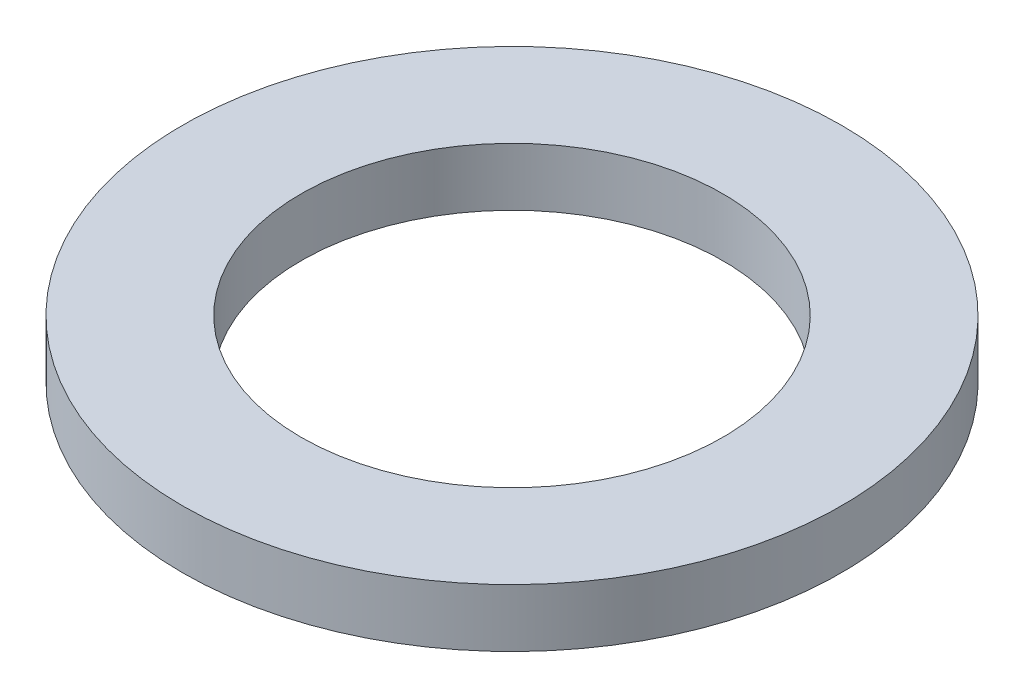
ISO-10303-21;
HEADER;
FILE_DESCRIPTION(('STEP AP214'),'2;1');
FILE_NAME('part.step','',(''),(''),'','','');
FILE_SCHEMA(('AUTOMOTIVE_DESIGN { 1 0 10303 214 1 1 1 1 }'));
ENDSEC;
DATA;
#1=APPLICATION_CONTEXT('core data for automotive mechanical design processes');
#2=APPLICATION_PROTOCOL_DEFINITION('international standard','automotive_design',2000,#1);
#3=PRODUCT_CONTEXT('',#1,'mechanical');
#4=PRODUCT('Part','Part','',(#3));
#5=PRODUCT_RELATED_PRODUCT_CATEGORY('part','',(#4));
#6=PRODUCT_DEFINITION_FORMATION('','',#4);
#7=PRODUCT_DEFINITION_CONTEXT('part definition',#1,'design');
#8=PRODUCT_DEFINITION('design','',#6,#7);
#9=PRODUCT_DEFINITION_SHAPE('','',#8);
#10=(LENGTH_UNIT() NAMED_UNIT(*) SI_UNIT(.MILLI.,.METRE.));
#11=(NAMED_UNIT(*) PLANE_ANGLE_UNIT() SI_UNIT($,.RADIAN.));
#12=(NAMED_UNIT(*) SI_UNIT($,.STERADIAN.) SOLID_ANGLE_UNIT());
#13=UNCERTAINTY_MEASURE_WITH_UNIT(LENGTH_MEASURE(1.E-05),#10,'distance_accuracy_value','');
#14=(GEOMETRIC_REPRESENTATION_CONTEXT(3) GLOBAL_UNCERTAINTY_ASSIGNED_CONTEXT((#13)) GLOBAL_UNIT_ASSIGNED_CONTEXT((#10,
#11,#12)) REPRESENTATION_CONTEXT('',''));
#15=CARTESIAN_POINT('',(0.,0.,0.));
#16=DIRECTION('',(0.,0.,1.));
#17=DIRECTION('',(1.,0.,0.));
#18=AXIS2_PLACEMENT_3D('',#15,#16,#17);
#19=CARTESIAN_POINT('',(0.,11.,0.));
#20=DIRECTION('',(0.,-1.,0.));
#21=DIRECTION('',(0.,0.,-1.));
#22=AXIS2_PLACEMENT_3D('',#19,#20,#21);
#23=CYLINDRICAL_SURFACE('',#22,62.5);
#24=CARTESIAN_POINT('',(0.,11.,0.));
#25=DIRECTION('',(0.,1.,0.));
#26=DIRECTION('',(0.,0.,1.));
#27=AXIS2_PLACEMENT_3D('',#24,#25,#26);
#28=CIRCLE('',#27,62.5);
#29=CARTESIAN_POINT('',(0.,11.,62.5));
#30=VERTEX_POINT('',#29);
#31=EDGE_CURVE('E10',#30,#30,#28,.T.);
#32=ORIENTED_EDGE('',*,*,#31,.F.);
#33=EDGE_LOOP('',(#32));
#34=FACE_BOUND('',#33,.T.);
#35=CARTESIAN_POINT('',(0.,0.,0.));
#36=DIRECTION('',(0.,1.,0.));
#37=DIRECTION('',(0.,0.,1.));
#38=AXIS2_PLACEMENT_3D('',#35,#36,#37);
#39=CIRCLE('',#38,62.5);
#40=CARTESIAN_POINT('',(0.,0.,62.5));
#41=VERTEX_POINT('',#40);
#42=EDGE_CURVE('E37',#41,#41,#39,.T.);
#43=ORIENTED_EDGE('',*,*,#42,.T.);
#44=EDGE_LOOP('',(#43));
#45=FACE_BOUND('',#44,.T.);
#46=ADVANCED_FACE('F40',(#34,#45),#23,.T.);
#47=CARTESIAN_POINT('',(0.,11.,0.));
#48=DIRECTION('',(0.,1.,0.));
#49=DIRECTION('',(0.,0.,1.));
#50=AXIS2_PLACEMENT_3D('',#47,#48,#49);
#51=PLANE('',#50);
#52=CARTESIAN_POINT('',(0.,11.,0.));
#53=DIRECTION('',(0.,1.,0.));
#54=DIRECTION('',(0.,0.,1.));
#55=AXIS2_PLACEMENT_3D('',#52,#53,#54);
#56=CIRCLE('',#55,40.);
#57=CARTESIAN_POINT('',(0.,11.,40.));
#58=VERTEX_POINT('',#57);
#59=EDGE_CURVE('E50',#58,#58,#56,.T.);
#60=ORIENTED_EDGE('',*,*,#59,.F.);
#61=EDGE_LOOP('',(#60));
#62=FACE_BOUND('',#61,.T.);
#63=ORIENTED_EDGE('',*,*,#31,.T.);
#64=EDGE_LOOP('',(#63));
#65=FACE_BOUND('',#64,.T.);
#66=ADVANCED_FACE('F59',(#62,#65),#51,.T.);
#67=CARTESIAN_POINT('',(0.,0.,0.));
#68=DIRECTION('',(0.,1.,0.));
#69=DIRECTION('',(0.,0.,1.));
#70=AXIS2_PLACEMENT_3D('',#67,#68,#69);
#71=PLANE('',#70);
#72=CARTESIAN_POINT('',(0.,0.,0.));
#73=DIRECTION('',(0.,1.,0.));
#74=DIRECTION('',(0.,0.,1.));
#75=AXIS2_PLACEMENT_3D('',#72,#73,#74);
#76=CIRCLE('',#75,40.);
#77=CARTESIAN_POINT('',(0.,0.,40.));
#78=VERTEX_POINT('',#77);
#79=EDGE_CURVE('E47',#78,#78,#76,.T.);
#80=ORIENTED_EDGE('',*,*,#79,.T.);
#81=EDGE_LOOP('',(#80));
#82=FACE_BOUND('',#81,.T.);
#83=ORIENTED_EDGE('',*,*,#42,.F.);
#84=EDGE_LOOP('',(#83));
#85=FACE_BOUND('',#84,.T.);
#86=ADVANCED_FACE('F58',(#82,#85),#71,.F.);
#87=CARTESIAN_POINT('',(0.,11.,0.));
#88=DIRECTION('',(0.,-1.,0.));
#89=DIRECTION('',(0.,0.,-1.));
#90=AXIS2_PLACEMENT_3D('',#87,#88,#89);
#91=CYLINDRICAL_SURFACE('',#90,40.);
#92=ORIENTED_EDGE('',*,*,#59,.T.);
#93=EDGE_LOOP('',(#92));
#94=FACE_BOUND('',#93,.T.);
#95=ORIENTED_EDGE('',*,*,#79,.F.);
#96=EDGE_LOOP('',(#95));
#97=FACE_BOUND('',#96,.T.);
#98=ADVANCED_FACE('F54',(#94,#97),#91,.F.);
#99=CLOSED_SHELL('',(#46,#66,#86,#98));
#100=MANIFOLD_SOLID_BREP('B2',#99);
#101=ADVANCED_BREP_SHAPE_REPRESENTATION('',(#18,#100),#14);
#102=SHAPE_DEFINITION_REPRESENTATION(#9,#101);
ENDSEC;
END-ISO-10303-21;
